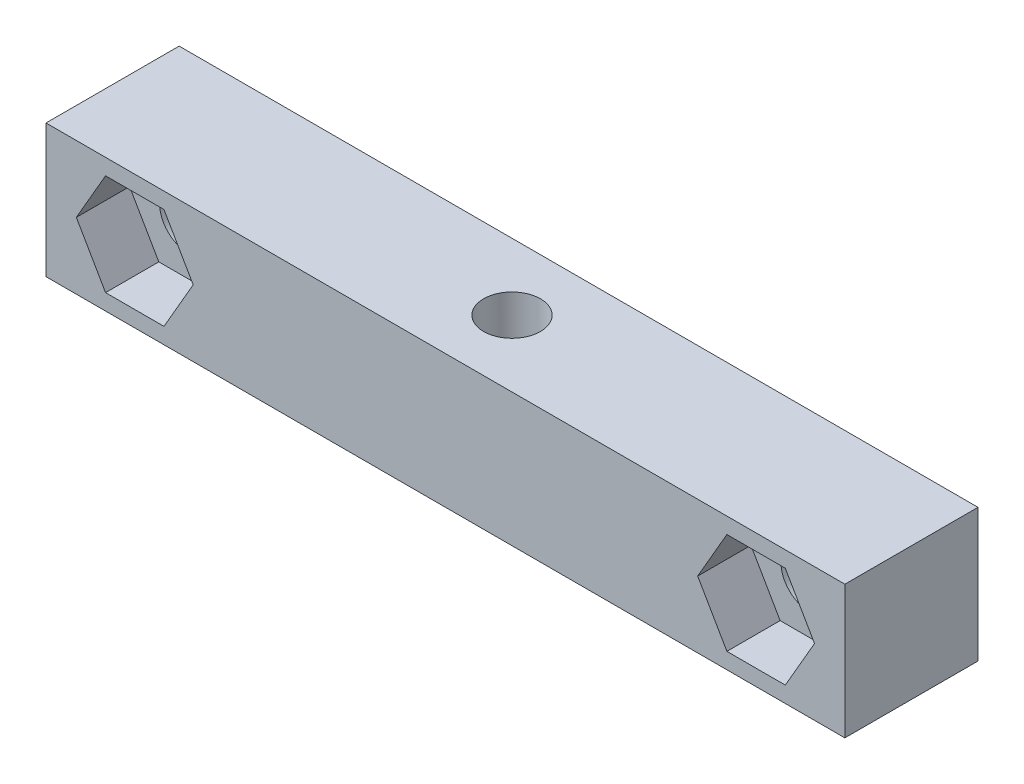
ISO-10303-21;
HEADER;
FILE_DESCRIPTION(('STEP AP214'),'2;1');
FILE_NAME('part.step','',(''),(''),'','','');
FILE_SCHEMA(('AUTOMOTIVE_DESIGN { 1 0 10303 214 1 1 1 1 }'));
ENDSEC;
DATA;
#1=APPLICATION_CONTEXT('core data for automotive mechanical design processes');
#2=APPLICATION_PROTOCOL_DEFINITION('international standard','automotive_design',2000,#1);
#3=PRODUCT_CONTEXT('',#1,'mechanical');
#4=PRODUCT('Part','Part','',(#3));
#5=PRODUCT_RELATED_PRODUCT_CATEGORY('part','',(#4));
#6=PRODUCT_DEFINITION_FORMATION('','',#4);
#7=PRODUCT_DEFINITION_CONTEXT('part definition',#1,'design');
#8=PRODUCT_DEFINITION('design','',#6,#7);
#9=PRODUCT_DEFINITION_SHAPE('','',#8);
#10=(LENGTH_UNIT() NAMED_UNIT(*) SI_UNIT(.MILLI.,.METRE.));
#11=(NAMED_UNIT(*) PLANE_ANGLE_UNIT() SI_UNIT($,.RADIAN.));
#12=(NAMED_UNIT(*) SI_UNIT($,.STERADIAN.) SOLID_ANGLE_UNIT());
#13=UNCERTAINTY_MEASURE_WITH_UNIT(LENGTH_MEASURE(1.E-05),#10,'distance_accuracy_value','');
#14=(GEOMETRIC_REPRESENTATION_CONTEXT(3) GLOBAL_UNCERTAINTY_ASSIGNED_CONTEXT((#13)) GLOBAL_UNIT_ASSIGNED_CONTEXT((#10,
#11,#12)) REPRESENTATION_CONTEXT('',''));
#15=CARTESIAN_POINT('',(0.,0.,0.));
#16=DIRECTION('',(0.,0.,1.));
#17=DIRECTION('',(1.,0.,0.));
#18=AXIS2_PLACEMENT_3D('',#15,#16,#17);
#19=CARTESIAN_POINT('',(17.5,0.,7.5));
#20=DIRECTION('',(0.,0.,-1.));
#21=DIRECTION('',(-1.,0.,0.));
#22=AXIS2_PLACEMENT_3D('',#19,#20,#21);
#23=CYLINDRICAL_SURFACE('',#22,1.6);
#24=CARTESIAN_POINT('',(17.5,0.,0.));
#25=DIRECTION('',(0.,0.,1.));
#26=DIRECTION('',(1.,0.,0.));
#27=AXIS2_PLACEMENT_3D('',#24,#25,#26);
#28=CIRCLE('',#27,1.6);
#29=CARTESIAN_POINT('',(19.1,0.,0.));
#30=VERTEX_POINT('',#29);
#31=EDGE_CURVE('E336',#30,#30,#28,.T.);
#32=ORIENTED_EDGE('',*,*,#31,.F.);
#33=EDGE_LOOP('',(#32));
#34=FACE_BOUND('',#33,.T.);
#35=CARTESIAN_POINT('',(17.5,0.,4.5));
#36=DIRECTION('',(0.,0.,1.));
#37=DIRECTION('',(1.,0.,0.));
#38=AXIS2_PLACEMENT_3D('',#35,#36,#37);
#39=CIRCLE('',#38,1.6);
#40=CARTESIAN_POINT('',(19.1,0.,4.5));
#41=VERTEX_POINT('',#40);
#42=EDGE_CURVE('E36',#41,#41,#39,.T.);
#43=ORIENTED_EDGE('',*,*,#42,.T.);
#44=EDGE_LOOP('',(#43));
#45=FACE_BOUND('',#44,.T.);
#46=ADVANCED_FACE('F32',(#34,#45),#23,.F.);
#47=CARTESIAN_POINT('',(-17.5,0.,7.5));
#48=DIRECTION('',(0.,0.,-1.));
#49=DIRECTION('',(-1.,0.,0.));
#50=AXIS2_PLACEMENT_3D('',#47,#48,#49);
#51=CYLINDRICAL_SURFACE('',#50,1.6);
#52=CARTESIAN_POINT('',(-17.5,0.,0.));
#53=DIRECTION('',(0.,0.,1.));
#54=DIRECTION('',(1.,0.,0.));
#55=AXIS2_PLACEMENT_3D('',#52,#53,#54);
#56=CIRCLE('',#55,1.6);
#57=CARTESIAN_POINT('',(-15.9,0.,0.));
#58=VERTEX_POINT('',#57);
#59=EDGE_CURVE('E339',#58,#58,#56,.T.);
#60=ORIENTED_EDGE('',*,*,#59,.F.);
#61=EDGE_LOOP('',(#60));
#62=FACE_BOUND('',#61,.T.);
#63=CARTESIAN_POINT('',(-17.5,0.,4.5));
#64=DIRECTION('',(0.,0.,1.));
#65=DIRECTION('',(1.,0.,0.));
#66=AXIS2_PLACEMENT_3D('',#63,#64,#65);
#67=CIRCLE('',#66,1.6);
#68=CARTESIAN_POINT('',(-15.9,0.,4.5));
#69=VERTEX_POINT('',#68);
#70=EDGE_CURVE('E274',#69,#69,#67,.T.);
#71=ORIENTED_EDGE('',*,*,#70,.T.);
#72=EDGE_LOOP('',(#71));
#73=FACE_BOUND('',#72,.T.);
#74=ADVANCED_FACE('F372',(#62,#73),#51,.F.);
#75=CARTESIAN_POINT('',(-1.1149224868951E-13,-3.75100000000001,3.75));
#76=DIRECTION('',(0.,1.,0.));
#77=DIRECTION('',(-1.,0.,0.));
#78=AXIS2_PLACEMENT_3D('',#75,#76,#77);
#79=CYLINDRICAL_SURFACE('',#78,1.6);
#80=CARTESIAN_POINT('',(-1.10552481521105E-13,3.74999999999999,3.75));
#81=DIRECTION('',(0.,1.,0.));
#82=DIRECTION('',(-1.,0.,0.));
#83=AXIS2_PLACEMENT_3D('',#80,#81,#82);
#84=CIRCLE('',#83,1.6);
#85=CARTESIAN_POINT('',(-1.60000000000011,3.74999999999999,3.75));
#86=VERTEX_POINT('',#85);
#87=EDGE_CURVE('E333',#86,#86,#84,.T.);
#88=ORIENTED_EDGE('',*,*,#87,.T.);
#89=EDGE_LOOP('',(#88));
#90=FACE_BOUND('',#89,.T.);
#91=CARTESIAN_POINT('',(-1.11116266650798E-13,-0.749999999999997,3.75));
#92=DIRECTION('',(0.,-1.,0.));
#93=DIRECTION('',(1.,0.,0.));
#94=AXIS2_PLACEMENT_3D('',#91,#92,#93);
#95=CIRCLE('',#94,1.6);
#96=CARTESIAN_POINT('',(1.59999999999989,-0.749999999999996,3.75));
#97=VERTEX_POINT('',#96);
#98=EDGE_CURVE('E322',#97,#97,#95,.F.);
#99=ORIENTED_EDGE('',*,*,#98,.F.);
#100=EDGE_LOOP('',(#99));
#101=FACE_BOUND('',#100,.T.);
#102=ADVANCED_FACE('F405',(#90,#101),#79,.F.);
#103=CARTESIAN_POINT('',(-22.5000000000001,3.74999999999999,7.5));
#104=DIRECTION('',(0.,0.,1.));
#105=DIRECTION('',(1.,0.,0.));
#106=AXIS2_PLACEMENT_3D('',#103,#104,#105);
#107=PLANE('',#106);
#108=DIRECTION('',(0.5,0.866025403784439,0.));
#109=VECTOR('',#108,1.);
#110=CARTESIAN_POINT('',(19.1454482671904,-2.85,7.5));
#111=LINE('',#110,#109);
#112=CARTESIAN_POINT('',(19.1454482671904,-2.85,7.5));
#113=VERTEX_POINT('',#112);
#114=CARTESIAN_POINT('',(20.7908965343809,0.,7.5));
#115=VERTEX_POINT('',#114);
#116=EDGE_CURVE('E49',#113,#115,#111,.T.);
#117=ORIENTED_EDGE('',*,*,#116,.F.);
#118=DIRECTION('',(1.,0.,0.));
#119=VECTOR('',#118,1.);
#120=CARTESIAN_POINT('',(15.8545517328096,-2.85,7.5));
#121=LINE('',#120,#119);
#122=CARTESIAN_POINT('',(15.8545517328096,-2.85,7.5));
#123=VERTEX_POINT('',#122);
#124=EDGE_CURVE('E204',#123,#113,#121,.T.);
#125=ORIENTED_EDGE('',*,*,#124,.F.);
#126=DIRECTION('',(0.5,-0.866025403784439,0.));
#127=VECTOR('',#126,1.);
#128=CARTESIAN_POINT('',(14.2091034656191,0.,7.5));
#129=LINE('',#128,#127);
#130=CARTESIAN_POINT('',(14.2091034656191,0.,7.5));
#131=VERTEX_POINT('',#130);
#132=EDGE_CURVE('E207',#131,#123,#129,.T.);
#133=ORIENTED_EDGE('',*,*,#132,.F.);
#134=DIRECTION('',(-0.5,-0.866025403784438,0.));
#135=VECTOR('',#134,1.);
#136=CARTESIAN_POINT('',(15.8545517328096,2.85,7.5));
#137=LINE('',#136,#135);
#138=CARTESIAN_POINT('',(15.8545517328096,2.85,7.5));
#139=VERTEX_POINT('',#138);
#140=EDGE_CURVE('E223',#139,#131,#137,.T.);
#141=ORIENTED_EDGE('',*,*,#140,.F.);
#142=DIRECTION('',(-1.,0.,0.));
#143=VECTOR('',#142,1.);
#144=CARTESIAN_POINT('',(19.1454482671904,2.85,7.5));
#145=LINE('',#144,#143);
#146=CARTESIAN_POINT('',(19.1454482671904,2.85,7.5));
#147=VERTEX_POINT('',#146);
#148=EDGE_CURVE('E220',#147,#139,#145,.T.);
#149=ORIENTED_EDGE('',*,*,#148,.F.);
#150=DIRECTION('',(-0.5,0.866025403784439,0.));
#151=VECTOR('',#150,1.);
#152=CARTESIAN_POINT('',(20.7908965343809,0.,7.5));
#153=LINE('',#152,#151);
#154=EDGE_CURVE('E218',#115,#147,#153,.T.);
#155=ORIENTED_EDGE('',*,*,#154,.F.);
#156=EDGE_LOOP('',(#117,#125,#133,#141,#149,#155));
#157=FACE_BOUND('',#156,.T.);
#158=DIRECTION('',(0.5,0.866025403784439,0.));
#159=VECTOR('',#158,1.);
#160=CARTESIAN_POINT('',(-15.8545517328096,-2.85,7.5));
#161=LINE('',#160,#159);
#162=CARTESIAN_POINT('',(-15.8545517328096,-2.85,7.5));
#163=VERTEX_POINT('',#162);
#164=CARTESIAN_POINT('',(-14.2091034656191,0.,7.5));
#165=VERTEX_POINT('',#164);
#166=EDGE_CURVE('E57',#163,#165,#161,.T.);
#167=ORIENTED_EDGE('',*,*,#166,.F.);
#168=DIRECTION('',(1.,0.,0.));
#169=VECTOR('',#168,1.);
#170=CARTESIAN_POINT('',(-19.1454482671904,-2.85,7.5));
#171=LINE('',#170,#169);
#172=CARTESIAN_POINT('',(-19.1454482671904,-2.85,7.5));
#173=VERTEX_POINT('',#172);
#174=EDGE_CURVE('E241',#173,#163,#171,.T.);
#175=ORIENTED_EDGE('',*,*,#174,.F.);
#176=DIRECTION('',(0.5,-0.866025403784439,0.));
#177=VECTOR('',#176,1.);
#178=CARTESIAN_POINT('',(-20.7908965343809,0.,7.5));
#179=LINE('',#178,#177);
#180=CARTESIAN_POINT('',(-20.7908965343809,0.,7.5));
#181=VERTEX_POINT('',#180);
#182=EDGE_CURVE('E267',#181,#173,#179,.T.);
#183=ORIENTED_EDGE('',*,*,#182,.F.);
#184=DIRECTION('',(-0.5,-0.866025403784439,0.));
#185=VECTOR('',#184,1.);
#186=CARTESIAN_POINT('',(-19.1454482671904,2.85000000000001,7.5));
#187=LINE('',#186,#185);
#188=CARTESIAN_POINT('',(-19.1454482671904,2.85000000000001,7.5));
#189=VERTEX_POINT('',#188);
#190=EDGE_CURVE('E264',#189,#181,#187,.T.);
#191=ORIENTED_EDGE('',*,*,#190,.F.);
#192=DIRECTION('',(-1.,0.,0.));
#193=VECTOR('',#192,1.);
#194=CARTESIAN_POINT('',(-15.8545517328096,2.85000000000001,7.5));
#195=LINE('',#194,#193);
#196=CARTESIAN_POINT('',(-15.8545517328096,2.85000000000001,7.5));
#197=VERTEX_POINT('',#196);
#198=EDGE_CURVE('E261',#197,#189,#195,.T.);
#199=ORIENTED_EDGE('',*,*,#198,.F.);
#200=DIRECTION('',(-0.5,0.866025403784439,0.));
#201=VECTOR('',#200,1.);
#202=CARTESIAN_POINT('',(-14.2091034656191,0.,7.5));
#203=LINE('',#202,#201);
#204=EDGE_CURVE('E258',#165,#197,#203,.T.);
#205=ORIENTED_EDGE('',*,*,#204,.F.);
#206=EDGE_LOOP('',(#167,#175,#183,#191,#199,#205));
#207=FACE_BOUND('',#206,.T.);
#208=DIRECTION('',(0.,-1.,0.));
#209=VECTOR('',#208,1.);
#210=CARTESIAN_POINT('',(-22.5000000000001,-3.75000000000001,7.5));
#211=LINE('',#210,#209);
#212=CARTESIAN_POINT('',(-22.5000000000001,3.74999999999999,7.5));
#213=VERTEX_POINT('',#212);
#214=CARTESIAN_POINT('',(-22.5000000000001,-3.75000000000001,7.5));
#215=VERTEX_POINT('',#214);
#216=EDGE_CURVE('E343',#213,#215,#211,.T.);
#217=ORIENTED_EDGE('',*,*,#216,.T.);
#218=DIRECTION('',(1.,0.,0.));
#219=VECTOR('',#218,1.);
#220=CARTESIAN_POINT('',(22.4999999999999,-3.74999999999998,7.5));
#221=LINE('',#220,#219);
#222=CARTESIAN_POINT('',(22.4999999999999,-3.74999999999998,7.5));
#223=VERTEX_POINT('',#222);
#224=EDGE_CURVE('E346',#215,#223,#221,.T.);
#225=ORIENTED_EDGE('',*,*,#224,.T.);
#226=DIRECTION('',(0.,1.,0.));
#227=VECTOR('',#226,1.);
#228=CARTESIAN_POINT('',(22.4999999999999,-3.74999999999998,7.5));
#229=LINE('',#228,#227);
#230=CARTESIAN_POINT('',(22.4999999999999,3.74999999999998,7.5));
#231=VERTEX_POINT('',#230);
#232=EDGE_CURVE('E349',#223,#231,#229,.T.);
#233=ORIENTED_EDGE('',*,*,#232,.T.);
#234=DIRECTION('',(-1.,0.,0.));
#235=VECTOR('',#234,1.);
#236=CARTESIAN_POINT('',(22.4999999999999,3.74999999999998,7.5));
#237=LINE('',#236,#235);
#238=EDGE_CURVE('E351',#231,#213,#237,.T.);
#239=ORIENTED_EDGE('',*,*,#238,.T.);
#240=EDGE_LOOP('',(#217,#225,#233,#239));
#241=FACE_BOUND('',#240,.T.);
#242=ADVANCED_FACE('F401',(#157,#207,#241),#107,.T.);
#243=CARTESIAN_POINT('',(-22.5000000000001,3.74999999999999,0.));
#244=DIRECTION('',(0.,0.,1.));
#245=DIRECTION('',(1.,0.,0.));
#246=AXIS2_PLACEMENT_3D('',#243,#244,#245);
#247=PLANE('',#246);
#248=ORIENTED_EDGE('',*,*,#59,.T.);
#249=EDGE_LOOP('',(#248));
#250=FACE_BOUND('',#249,.T.);
#251=DIRECTION('',(0.,-1.,0.));
#252=VECTOR('',#251,1.);
#253=CARTESIAN_POINT('',(-22.5000000000001,-3.75000000000001,0.));
#254=LINE('',#253,#252);
#255=CARTESIAN_POINT('',(-22.5000000000001,3.74999999999999,0.));
#256=VERTEX_POINT('',#255);
#257=CARTESIAN_POINT('',(-22.5000000000001,-3.75000000000001,0.));
#258=VERTEX_POINT('',#257);
#259=EDGE_CURVE('E342',#256,#258,#254,.T.);
#260=ORIENTED_EDGE('',*,*,#259,.F.);
#261=DIRECTION('',(-1.,0.,0.));
#262=VECTOR('',#261,1.);
#263=CARTESIAN_POINT('',(22.4999999999999,3.74999999999998,0.));
#264=LINE('',#263,#262);
#265=CARTESIAN_POINT('',(22.4999999999999,3.74999999999998,0.));
#266=VERTEX_POINT('',#265);
#267=EDGE_CURVE('E347',#266,#256,#264,.T.);
#268=ORIENTED_EDGE('',*,*,#267,.F.);
#269=DIRECTION('',(0.,1.,0.));
#270=VECTOR('',#269,1.);
#271=CARTESIAN_POINT('',(22.4999999999999,-3.74999999999998,0.));
#272=LINE('',#271,#270);
#273=CARTESIAN_POINT('',(22.4999999999999,-3.74999999999998,0.));
#274=VERTEX_POINT('',#273);
#275=EDGE_CURVE('E358',#274,#266,#272,.T.);
#276=ORIENTED_EDGE('',*,*,#275,.F.);
#277=DIRECTION('',(1.,0.,0.));
#278=VECTOR('',#277,1.);
#279=CARTESIAN_POINT('',(22.4999999999999,-3.74999999999998,0.));
#280=LINE('',#279,#278);
#281=EDGE_CURVE('E356',#258,#274,#280,.T.);
#282=ORIENTED_EDGE('',*,*,#281,.F.);
#283=EDGE_LOOP('',(#260,#268,#276,#282));
#284=FACE_BOUND('',#283,.T.);
#285=ORIENTED_EDGE('',*,*,#31,.T.);
#286=EDGE_LOOP('',(#285));
#287=FACE_BOUND('',#286,.T.);
#288=ADVANCED_FACE('F404',(#250,#284,#287),#247,.F.);
#289=CARTESIAN_POINT('',(-22.5000000000001,-3.75000000000001,7.5));
#290=DIRECTION('',(1.,0.,0.));
#291=DIRECTION('',(0.,0.,-1.));
#292=AXIS2_PLACEMENT_3D('',#289,#290,#291);
#293=PLANE('',#292);
#294=ORIENTED_EDGE('',*,*,#259,.T.);
#295=DIRECTION('',(0.,0.,-1.));
#296=VECTOR('',#295,1.);
#297=CARTESIAN_POINT('',(-22.5000000000001,-3.75000000000001,7.5));
#298=LINE('',#297,#296);
#299=EDGE_CURVE('E11',#215,#258,#298,.T.);
#300=ORIENTED_EDGE('',*,*,#299,.F.);
#301=ORIENTED_EDGE('',*,*,#216,.F.);
#302=DIRECTION('',(0.,0.,-1.));
#303=VECTOR('',#302,1.);
#304=CARTESIAN_POINT('',(-22.5000000000001,3.74999999999999,7.5));
#305=LINE('',#304,#303);
#306=EDGE_CURVE('E353',#213,#256,#305,.T.);
#307=ORIENTED_EDGE('',*,*,#306,.T.);
#308=EDGE_LOOP('',(#294,#300,#301,#307));
#309=FACE_BOUND('',#308,.T.);
#310=ADVANCED_FACE('F34',(#309),#293,.F.);
#311=CARTESIAN_POINT('',(22.4999999999999,-3.74999999999998,7.5));
#312=DIRECTION('',(0.,1.,0.));
#313=DIRECTION('',(-1.,0.,0.));
#314=AXIS2_PLACEMENT_3D('',#311,#312,#313);
#315=PLANE('',#314);
#316=DIRECTION('',(-0.5,0.,0.866025403784439));
#317=VECTOR('',#316,1.);
#318=CARTESIAN_POINT('',(3.29089653438076,-3.74999999999999,3.75));
#319=LINE('',#318,#317);
#320=CARTESIAN_POINT('',(3.29089653438075,-3.74999999999999,3.75));
#321=VERTEX_POINT('',#320);
#322=CARTESIAN_POINT('',(1.64544826719032,-3.75,6.6));
#323=VERTEX_POINT('',#322);
#324=EDGE_CURVE('E306',#321,#323,#319,.T.);
#325=ORIENTED_EDGE('',*,*,#324,.F.);
#326=DIRECTION('',(0.5,0.,0.866025403784439));
#327=VECTOR('',#326,1.);
#328=CARTESIAN_POINT('',(1.64544826719032,-3.75,0.899999999999998));
#329=LINE('',#328,#327);
#330=CARTESIAN_POINT('',(1.64544826719032,-3.75,0.899999999999998));
#331=VERTEX_POINT('',#330);
#332=EDGE_CURVE('E304',#331,#321,#329,.T.);
#333=ORIENTED_EDGE('',*,*,#332,.F.);
#334=DIRECTION('',(1.,0.,0.));
#335=VECTOR('',#334,1.);
#336=CARTESIAN_POINT('',(-1.64544826719055,-3.75,0.899999999999999));
#337=LINE('',#336,#335);
#338=CARTESIAN_POINT('',(-1.64544826719055,-3.75,0.899999999999999));
#339=VERTEX_POINT('',#338);
#340=EDGE_CURVE('E288',#339,#331,#337,.T.);
#341=ORIENTED_EDGE('',*,*,#340,.F.);
#342=DIRECTION('',(0.5,0.,-0.866025403784439));
#343=VECTOR('',#342,1.);
#344=CARTESIAN_POINT('',(-3.29089653438098,-3.75,3.75));
#345=LINE('',#344,#343);
#346=CARTESIAN_POINT('',(-3.29089653438098,-3.75,3.75));
#347=VERTEX_POINT('',#346);
#348=EDGE_CURVE('E315',#347,#339,#345,.T.);
#349=ORIENTED_EDGE('',*,*,#348,.F.);
#350=DIRECTION('',(-0.5,0.,-0.866025403784439));
#351=VECTOR('',#350,1.);
#352=CARTESIAN_POINT('',(-1.64544826719055,-3.75,6.6));
#353=LINE('',#352,#351);
#354=CARTESIAN_POINT('',(-1.64544826719055,-3.75,6.6));
#355=VERTEX_POINT('',#354);
#356=EDGE_CURVE('E312',#355,#347,#353,.T.);
#357=ORIENTED_EDGE('',*,*,#356,.F.);
#358=DIRECTION('',(-1.,0.,0.));
#359=VECTOR('',#358,1.);
#360=CARTESIAN_POINT('',(1.64544826719032,-3.75,6.6));
#361=LINE('',#360,#359);
#362=EDGE_CURVE('E309',#323,#355,#361,.T.);
#363=ORIENTED_EDGE('',*,*,#362,.F.);
#364=EDGE_LOOP('',(#325,#333,#341,#349,#357,#363));
#365=FACE_BOUND('',#364,.T.);
#366=ORIENTED_EDGE('',*,*,#281,.T.);
#367=DIRECTION('',(0.,0.,-1.));
#368=VECTOR('',#367,1.);
#369=CARTESIAN_POINT('',(22.4999999999999,-3.74999999999998,7.5));
#370=LINE('',#369,#368);
#371=EDGE_CURVE('E41',#223,#274,#370,.T.);
#372=ORIENTED_EDGE('',*,*,#371,.F.);
#373=ORIENTED_EDGE('',*,*,#224,.F.);
#374=ORIENTED_EDGE('',*,*,#299,.T.);
#375=EDGE_LOOP('',(#366,#372,#373,#374));
#376=FACE_BOUND('',#375,.T.);
#377=ADVANCED_FACE('F416',(#365,#376),#315,.F.);
#378=CARTESIAN_POINT('',(22.4999999999999,-3.74999999999998,7.5));
#379=DIRECTION('',(-1.,0.,0.));
#380=DIRECTION('',(0.,0.,1.));
#381=AXIS2_PLACEMENT_3D('',#378,#379,#380);
#382=PLANE('',#381);
#383=ORIENTED_EDGE('',*,*,#275,.T.);
#384=DIRECTION('',(0.,0.,-1.));
#385=VECTOR('',#384,1.);
#386=CARTESIAN_POINT('',(22.4999999999999,3.74999999999998,7.5));
#387=LINE('',#386,#385);
#388=EDGE_CURVE('E363',#231,#266,#387,.T.);
#389=ORIENTED_EDGE('',*,*,#388,.F.);
#390=ORIENTED_EDGE('',*,*,#232,.F.);
#391=ORIENTED_EDGE('',*,*,#371,.T.);
#392=EDGE_LOOP('',(#383,#389,#390,#391));
#393=FACE_BOUND('',#392,.T.);
#394=ADVANCED_FACE('F421',(#393),#382,.F.);
#395=CARTESIAN_POINT('',(22.4999999999999,3.74999999999998,7.5));
#396=DIRECTION('',(0.,-1.,0.));
#397=DIRECTION('',(1.,0.,0.));
#398=AXIS2_PLACEMENT_3D('',#395,#396,#397);
#399=PLANE('',#398);
#400=ORIENTED_EDGE('',*,*,#87,.F.);
#401=EDGE_LOOP('',(#400));
#402=FACE_BOUND('',#401,.T.);
#403=ORIENTED_EDGE('',*,*,#267,.T.);
#404=ORIENTED_EDGE('',*,*,#306,.F.);
#405=ORIENTED_EDGE('',*,*,#238,.F.);
#406=ORIENTED_EDGE('',*,*,#388,.T.);
#407=EDGE_LOOP('',(#403,#404,#405,#406));
#408=FACE_BOUND('',#407,.T.);
#409=ADVANCED_FACE('F424',(#402,#408),#399,.F.);
#410=CARTESIAN_POINT('',(3.29089653438075,-0.749999999999995,3.75));
#411=DIRECTION('',(0.,-1.,0.));
#412=DIRECTION('',(1.,0.,0.));
#413=AXIS2_PLACEMENT_3D('',#410,#411,#412);
#414=PLANE('',#413);
#415=DIRECTION('',(0.5,0.,0.866025403784439));
#416=VECTOR('',#415,1.);
#417=CARTESIAN_POINT('',(1.64544826719032,-0.749999999999996,0.899999999999998));
#418=LINE('',#417,#416);
#419=CARTESIAN_POINT('',(1.64544826719032,-0.749999999999996,0.899999999999998));
#420=VERTEX_POINT('',#419);
#421=CARTESIAN_POINT('',(3.29089653438075,-0.749999999999995,3.75));
#422=VERTEX_POINT('',#421);
#423=EDGE_CURVE('E284',#420,#422,#418,.T.);
#424=ORIENTED_EDGE('',*,*,#423,.T.);
#425=DIRECTION('',(-0.5,0.,0.866025403784439));
#426=VECTOR('',#425,1.);
#427=CARTESIAN_POINT('',(3.29089653438075,-0.749999999999995,3.75));
#428=LINE('',#427,#426);
#429=CARTESIAN_POINT('',(1.64544826719032,-0.749999999999996,6.6));
#430=VERTEX_POINT('',#429);
#431=EDGE_CURVE('E287',#422,#430,#428,.T.);
#432=ORIENTED_EDGE('',*,*,#431,.T.);
#433=DIRECTION('',(-1.,0.,0.));
#434=VECTOR('',#433,1.);
#435=CARTESIAN_POINT('',(1.64544826719032,-0.749999999999996,6.6));
#436=LINE('',#435,#434);
#437=CARTESIAN_POINT('',(-1.64544826719055,-0.749999999999998,6.6));
#438=VERTEX_POINT('',#437);
#439=EDGE_CURVE('E291',#430,#438,#436,.T.);
#440=ORIENTED_EDGE('',*,*,#439,.T.);
#441=DIRECTION('',(-0.5,0.,-0.866025403784439));
#442=VECTOR('',#441,1.);
#443=CARTESIAN_POINT('',(-1.64544826719055,-0.749999999999998,6.6));
#444=LINE('',#443,#442);
#445=CARTESIAN_POINT('',(-3.29089653438098,-0.749999999999999,3.75));
#446=VERTEX_POINT('',#445);
#447=EDGE_CURVE('E294',#438,#446,#444,.T.);
#448=ORIENTED_EDGE('',*,*,#447,.T.);
#449=DIRECTION('',(0.5,0.,-0.866025403784439));
#450=VECTOR('',#449,1.);
#451=CARTESIAN_POINT('',(-3.29089653438098,-0.749999999999999,3.75));
#452=LINE('',#451,#450);
#453=CARTESIAN_POINT('',(-1.64544826719055,-0.749999999999998,0.899999999999999));
#454=VERTEX_POINT('',#453);
#455=EDGE_CURVE('E297',#446,#454,#452,.T.);
#456=ORIENTED_EDGE('',*,*,#455,.T.);
#457=DIRECTION('',(1.,0.,0.));
#458=VECTOR('',#457,1.);
#459=CARTESIAN_POINT('',(-1.64544826719055,-0.749999999999998,0.899999999999999));
#460=LINE('',#459,#458);
#461=EDGE_CURVE('E300',#454,#420,#460,.T.);
#462=ORIENTED_EDGE('',*,*,#461,.T.);
#463=EDGE_LOOP('',(#424,#432,#440,#448,#456,#462));
#464=FACE_BOUND('',#463,.T.);
#465=ORIENTED_EDGE('',*,*,#98,.T.);
#466=EDGE_LOOP('',(#465));
#467=FACE_BOUND('',#466,.T.);
#468=ADVANCED_FACE('F476',(#464,#467),#414,.T.);
#469=CARTESIAN_POINT('',(1.64544826719032,-0.749999999999996,0.899999999999998));
#470=DIRECTION('',(0.866025403784439,0.,-0.5));
#471=DIRECTION('',(-0.5,0.,-0.866025403784439));
#472=AXIS2_PLACEMENT_3D('',#469,#470,#471);
#473=PLANE('',#472);
#474=ORIENTED_EDGE('',*,*,#332,.T.);
#475=DIRECTION('',(0.,-1.,0.));
#476=VECTOR('',#475,1.);
#477=CARTESIAN_POINT('',(3.29089653438075,-0.749999999999995,3.75));
#478=LINE('',#477,#476);
#479=EDGE_CURVE('E303',#422,#321,#478,.T.);
#480=ORIENTED_EDGE('',*,*,#479,.F.);
#481=ORIENTED_EDGE('',*,*,#423,.F.);
#482=DIRECTION('',(0.,-1.,0.));
#483=VECTOR('',#482,1.);
#484=CARTESIAN_POINT('',(1.64544826719032,-0.749999999999996,0.899999999999998));
#485=LINE('',#484,#483);
#486=EDGE_CURVE('E320',#420,#331,#485,.T.);
#487=ORIENTED_EDGE('',*,*,#486,.T.);
#488=EDGE_LOOP('',(#474,#480,#481,#487));
#489=FACE_BOUND('',#488,.T.);
#490=ADVANCED_FACE('F479',(#489),#473,.F.);
#491=CARTESIAN_POINT('',(-1.64544826719055,-0.749999999999998,0.899999999999999));
#492=DIRECTION('',(0.,0.,-1.));
#493=DIRECTION('',(-1.,0.,0.));
#494=AXIS2_PLACEMENT_3D('',#491,#492,#493);
#495=PLANE('',#494);
#496=ORIENTED_EDGE('',*,*,#340,.T.);
#497=ORIENTED_EDGE('',*,*,#486,.F.);
#498=ORIENTED_EDGE('',*,*,#461,.F.);
#499=DIRECTION('',(0.,-1.,0.));
#500=VECTOR('',#499,1.);
#501=CARTESIAN_POINT('',(-1.64544826719055,-0.749999999999998,0.899999999999999));
#502=LINE('',#501,#500);
#503=EDGE_CURVE('E323',#454,#339,#502,.T.);
#504=ORIENTED_EDGE('',*,*,#503,.T.);
#505=EDGE_LOOP('',(#496,#497,#498,#504));
#506=FACE_BOUND('',#505,.T.);
#507=ADVANCED_FACE('F481',(#506),#495,.F.);
#508=CARTESIAN_POINT('',(-3.29089653438098,-0.749999999999999,3.75));
#509=DIRECTION('',(-0.866025403784439,0.,-0.5));
#510=DIRECTION('',(-0.5,0.,0.866025403784439));
#511=AXIS2_PLACEMENT_3D('',#508,#509,#510);
#512=PLANE('',#511);
#513=ORIENTED_EDGE('',*,*,#348,.T.);
#514=ORIENTED_EDGE('',*,*,#503,.F.);
#515=ORIENTED_EDGE('',*,*,#455,.F.);
#516=DIRECTION('',(0.,-1.,0.));
#517=VECTOR('',#516,1.);
#518=CARTESIAN_POINT('',(-3.29089653438098,-0.749999999999999,3.75));
#519=LINE('',#518,#517);
#520=EDGE_CURVE('E325',#446,#347,#519,.T.);
#521=ORIENTED_EDGE('',*,*,#520,.T.);
#522=EDGE_LOOP('',(#513,#514,#515,#521));
#523=FACE_BOUND('',#522,.T.);
#524=ADVANCED_FACE('F484',(#523),#512,.F.);
#525=CARTESIAN_POINT('',(-1.64544826719055,-0.749999999999998,6.6));
#526=DIRECTION('',(-0.866025403784439,0.,0.5));
#527=DIRECTION('',(0.5,0.,0.866025403784439));
#528=AXIS2_PLACEMENT_3D('',#525,#526,#527);
#529=PLANE('',#528);
#530=ORIENTED_EDGE('',*,*,#356,.T.);
#531=ORIENTED_EDGE('',*,*,#520,.F.);
#532=ORIENTED_EDGE('',*,*,#447,.F.);
#533=DIRECTION('',(0.,-1.,0.));
#534=VECTOR('',#533,1.);
#535=CARTESIAN_POINT('',(-1.64544826719055,-0.749999999999998,6.6));
#536=LINE('',#535,#534);
#537=EDGE_CURVE('E327',#438,#355,#536,.T.);
#538=ORIENTED_EDGE('',*,*,#537,.T.);
#539=EDGE_LOOP('',(#530,#531,#532,#538));
#540=FACE_BOUND('',#539,.T.);
#541=ADVANCED_FACE('F488',(#540),#529,.F.);
#542=CARTESIAN_POINT('',(1.64544826719032,-0.749999999999996,6.6));
#543=DIRECTION('',(0.,0.,1.));
#544=DIRECTION('',(1.,0.,0.));
#545=AXIS2_PLACEMENT_3D('',#542,#543,#544);
#546=PLANE('',#545);
#547=ORIENTED_EDGE('',*,*,#362,.T.);
#548=ORIENTED_EDGE('',*,*,#537,.F.);
#549=ORIENTED_EDGE('',*,*,#439,.F.);
#550=DIRECTION('',(0.,-1.,0.));
#551=VECTOR('',#550,1.);
#552=CARTESIAN_POINT('',(1.64544826719032,-0.749999999999996,6.6));
#553=LINE('',#552,#551);
#554=EDGE_CURVE('E329',#430,#323,#553,.T.);
#555=ORIENTED_EDGE('',*,*,#554,.T.);
#556=EDGE_LOOP('',(#547,#548,#549,#555));
#557=FACE_BOUND('',#556,.T.);
#558=ADVANCED_FACE('F492',(#557),#546,.F.);
#559=CARTESIAN_POINT('',(3.29089653438075,-0.749999999999995,3.75));
#560=DIRECTION('',(0.866025403784439,0.,0.5));
#561=DIRECTION('',(0.5,0.,-0.866025403784439));
#562=AXIS2_PLACEMENT_3D('',#559,#560,#561);
#563=PLANE('',#562);
#564=ORIENTED_EDGE('',*,*,#324,.T.);
#565=ORIENTED_EDGE('',*,*,#554,.F.);
#566=ORIENTED_EDGE('',*,*,#431,.F.);
#567=ORIENTED_EDGE('',*,*,#479,.T.);
#568=EDGE_LOOP('',(#564,#565,#566,#567));
#569=FACE_BOUND('',#568,.T.);
#570=ADVANCED_FACE('F475',(#569),#563,.F.);
#571=CARTESIAN_POINT('',(-15.8545517328096,-2.85,4.5));
#572=DIRECTION('',(0.866025403784439,-0.5,0.));
#573=DIRECTION('',(0.5,0.866025403784439,0.));
#574=AXIS2_PLACEMENT_3D('',#571,#572,#573);
#575=PLANE('',#574);
#576=ORIENTED_EDGE('',*,*,#166,.T.);
#577=DIRECTION('',(0.,0.,1.));
#578=VECTOR('',#577,1.);
#579=CARTESIAN_POINT('',(-14.2091034656191,0.,4.5));
#580=LINE('',#579,#578);
#581=CARTESIAN_POINT('',(-14.2091034656191,0.,4.5));
#582=VERTEX_POINT('',#581);
#583=EDGE_CURVE('E256',#582,#165,#580,.T.);
#584=ORIENTED_EDGE('',*,*,#583,.F.);
#585=DIRECTION('',(0.5,0.866025403784439,0.));
#586=VECTOR('',#585,1.);
#587=CARTESIAN_POINT('',(-15.8545517328096,-2.85,4.5));
#588=LINE('',#587,#586);
#589=CARTESIAN_POINT('',(-15.8545517328096,-2.85,4.5));
#590=VERTEX_POINT('',#589);
#591=EDGE_CURVE('E237',#590,#582,#588,.T.);
#592=ORIENTED_EDGE('',*,*,#591,.F.);
#593=DIRECTION('',(0.,0.,1.));
#594=VECTOR('',#593,1.);
#595=CARTESIAN_POINT('',(-15.8545517328096,-2.85,4.5));
#596=LINE('',#595,#594);
#597=EDGE_CURVE('E272',#590,#163,#596,.T.);
#598=ORIENTED_EDGE('',*,*,#597,.T.);
#599=EDGE_LOOP('',(#576,#584,#592,#598));
#600=FACE_BOUND('',#599,.T.);
#601=ADVANCED_FACE('F382',(#600),#575,.F.);
#602=CARTESIAN_POINT('',(-19.1454482671904,-2.85,4.5));
#603=DIRECTION('',(0.,-1.,0.));
#604=DIRECTION('',(0.,0.,-1.));
#605=AXIS2_PLACEMENT_3D('',#602,#603,#604);
#606=PLANE('',#605);
#607=ORIENTED_EDGE('',*,*,#174,.T.);
#608=ORIENTED_EDGE('',*,*,#597,.F.);
#609=DIRECTION('',(1.,0.,0.));
#610=VECTOR('',#609,1.);
#611=CARTESIAN_POINT('',(-19.1454482671904,-2.85,4.5));
#612=LINE('',#611,#610);
#613=CARTESIAN_POINT('',(-19.1454482671904,-2.85,4.5));
#614=VERTEX_POINT('',#613);
#615=EDGE_CURVE('E253',#614,#590,#612,.T.);
#616=ORIENTED_EDGE('',*,*,#615,.F.);
#617=DIRECTION('',(0.,0.,1.));
#618=VECTOR('',#617,1.);
#619=CARTESIAN_POINT('',(-19.1454482671904,-2.85,4.5));
#620=LINE('',#619,#618);
#621=EDGE_CURVE('E275',#614,#173,#620,.T.);
#622=ORIENTED_EDGE('',*,*,#621,.T.);
#623=EDGE_LOOP('',(#607,#608,#616,#622));
#624=FACE_BOUND('',#623,.T.);
#625=ADVANCED_FACE('F399',(#624),#606,.F.);
#626=CARTESIAN_POINT('',(-20.7908965343809,0.,4.5));
#627=DIRECTION('',(-0.866025403784439,-0.5,0.));
#628=DIRECTION('',(0.5,-0.866025403784439,0.));
#629=AXIS2_PLACEMENT_3D('',#626,#627,#628);
#630=PLANE('',#629);
#631=ORIENTED_EDGE('',*,*,#182,.T.);
#632=ORIENTED_EDGE('',*,*,#621,.F.);
#633=DIRECTION('',(0.5,-0.866025403784439,0.));
#634=VECTOR('',#633,1.);
#635=CARTESIAN_POINT('',(-20.7908965343809,0.,4.5));
#636=LINE('',#635,#634);
#637=CARTESIAN_POINT('',(-20.7908965343809,0.,4.5));
#638=VERTEX_POINT('',#637);
#639=EDGE_CURVE('E250',#638,#614,#636,.T.);
#640=ORIENTED_EDGE('',*,*,#639,.F.);
#641=DIRECTION('',(0.,0.,1.));
#642=VECTOR('',#641,1.);
#643=CARTESIAN_POINT('',(-20.7908965343809,0.,4.5));
#644=LINE('',#643,#642);
#645=EDGE_CURVE('E277',#638,#181,#644,.T.);
#646=ORIENTED_EDGE('',*,*,#645,.T.);
#647=EDGE_LOOP('',(#631,#632,#640,#646));
#648=FACE_BOUND('',#647,.T.);
#649=ADVANCED_FACE('F396',(#648),#630,.F.);
#650=CARTESIAN_POINT('',(-19.1454482671904,2.85000000000001,4.5));
#651=DIRECTION('',(-0.866025403784439,0.5,0.));
#652=DIRECTION('',(-0.5,-0.866025403784439,0.));
#653=AXIS2_PLACEMENT_3D('',#650,#651,#652);
#654=PLANE('',#653);
#655=ORIENTED_EDGE('',*,*,#190,.T.);
#656=ORIENTED_EDGE('',*,*,#645,.F.);
#657=DIRECTION('',(-0.5,-0.866025403784439,0.));
#658=VECTOR('',#657,1.);
#659=CARTESIAN_POINT('',(-19.1454482671904,2.85000000000001,4.5));
#660=LINE('',#659,#658);
#661=CARTESIAN_POINT('',(-19.1454482671904,2.85000000000001,4.5));
#662=VERTEX_POINT('',#661);
#663=EDGE_CURVE('E247',#662,#638,#660,.T.);
#664=ORIENTED_EDGE('',*,*,#663,.F.);
#665=DIRECTION('',(0.,0.,1.));
#666=VECTOR('',#665,1.);
#667=CARTESIAN_POINT('',(-19.1454482671904,2.85000000000001,4.5));
#668=LINE('',#667,#666);
#669=EDGE_CURVE('E279',#662,#189,#668,.T.);
#670=ORIENTED_EDGE('',*,*,#669,.T.);
#671=EDGE_LOOP('',(#655,#656,#664,#670));
#672=FACE_BOUND('',#671,.T.);
#673=ADVANCED_FACE('F392',(#672),#654,.F.);
#674=CARTESIAN_POINT('',(-15.8545517328096,2.85000000000001,4.5));
#675=DIRECTION('',(0.,1.,0.));
#676=DIRECTION('',(-1.,0.,0.));
#677=AXIS2_PLACEMENT_3D('',#674,#675,#676);
#678=PLANE('',#677);
#679=ORIENTED_EDGE('',*,*,#198,.T.);
#680=ORIENTED_EDGE('',*,*,#669,.F.);
#681=DIRECTION('',(-1.,0.,0.));
#682=VECTOR('',#681,1.);
#683=CARTESIAN_POINT('',(-15.8545517328096,2.85000000000001,4.5));
#684=LINE('',#683,#682);
#685=CARTESIAN_POINT('',(-15.8545517328096,2.85000000000001,4.5));
#686=VERTEX_POINT('',#685);
#687=EDGE_CURVE('E244',#686,#662,#684,.T.);
#688=ORIENTED_EDGE('',*,*,#687,.F.);
#689=DIRECTION('',(0.,0.,1.));
#690=VECTOR('',#689,1.);
#691=CARTESIAN_POINT('',(-15.8545517328096,2.85000000000001,4.5));
#692=LINE('',#691,#690);
#693=EDGE_CURVE('E281',#686,#197,#692,.T.);
#694=ORIENTED_EDGE('',*,*,#693,.T.);
#695=EDGE_LOOP('',(#679,#680,#688,#694));
#696=FACE_BOUND('',#695,.T.);
#697=ADVANCED_FACE('F388',(#696),#678,.F.);
#698=CARTESIAN_POINT('',(-14.2091034656191,0.,4.5));
#699=DIRECTION('',(0.866025403784439,0.5,0.));
#700=DIRECTION('',(-0.5,0.866025403784439,0.));
#701=AXIS2_PLACEMENT_3D('',#698,#699,#700);
#702=PLANE('',#701);
#703=ORIENTED_EDGE('',*,*,#204,.T.);
#704=ORIENTED_EDGE('',*,*,#693,.F.);
#705=DIRECTION('',(-0.5,0.866025403784439,0.));
#706=VECTOR('',#705,1.);
#707=CARTESIAN_POINT('',(-14.2091034656191,0.,4.5));
#708=LINE('',#707,#706);
#709=EDGE_CURVE('E240',#582,#686,#708,.T.);
#710=ORIENTED_EDGE('',*,*,#709,.F.);
#711=ORIENTED_EDGE('',*,*,#583,.T.);
#712=EDGE_LOOP('',(#703,#704,#710,#711));
#713=FACE_BOUND('',#712,.T.);
#714=ADVANCED_FACE('F377',(#713),#702,.F.);
#715=CARTESIAN_POINT('',(-14.2091034656191,0.,4.5));
#716=DIRECTION('',(0.,0.,1.));
#717=DIRECTION('',(1.,0.,0.));
#718=AXIS2_PLACEMENT_3D('',#715,#716,#717);
#719=PLANE('',#718);
#720=ORIENTED_EDGE('',*,*,#70,.F.);
#721=EDGE_LOOP('',(#720));
#722=FACE_BOUND('',#721,.T.);
#723=ORIENTED_EDGE('',*,*,#591,.T.);
#724=ORIENTED_EDGE('',*,*,#709,.T.);
#725=ORIENTED_EDGE('',*,*,#687,.T.);
#726=ORIENTED_EDGE('',*,*,#663,.T.);
#727=ORIENTED_EDGE('',*,*,#639,.T.);
#728=ORIENTED_EDGE('',*,*,#615,.T.);
#729=EDGE_LOOP('',(#723,#724,#725,#726,#727,#728));
#730=FACE_BOUND('',#729,.T.);
#731=ADVANCED_FACE('F374',(#722,#730),#719,.T.);
#732=CARTESIAN_POINT('',(19.1454482671904,-2.85,4.5));
#733=DIRECTION('',(0.866025403784439,-0.5,0.));
#734=DIRECTION('',(0.5,0.866025403784439,0.));
#735=AXIS2_PLACEMENT_3D('',#732,#733,#734);
#736=PLANE('',#735);
#737=ORIENTED_EDGE('',*,*,#116,.T.);
#738=DIRECTION('',(0.,0.,1.));
#739=VECTOR('',#738,1.);
#740=CARTESIAN_POINT('',(20.7908965343809,0.,4.5));
#741=LINE('',#740,#739);
#742=CARTESIAN_POINT('',(20.7908965343809,0.,4.5));
#743=VERTEX_POINT('',#742);
#744=EDGE_CURVE('E181',#743,#115,#741,.T.);
#745=ORIENTED_EDGE('',*,*,#744,.F.);
#746=DIRECTION('',(0.5,0.866025403784439,0.));
#747=VECTOR('',#746,1.);
#748=CARTESIAN_POINT('',(19.1454482671904,-2.85,4.5));
#749=LINE('',#748,#747);
#750=CARTESIAN_POINT('',(19.1454482671904,-2.85,4.5));
#751=VERTEX_POINT('',#750);
#752=EDGE_CURVE('E185',#751,#743,#749,.T.);
#753=ORIENTED_EDGE('',*,*,#752,.F.);
#754=DIRECTION('',(0.,0.,1.));
#755=VECTOR('',#754,1.);
#756=CARTESIAN_POINT('',(19.1454482671904,-2.85,4.5));
#757=LINE('',#756,#755);
#758=EDGE_CURVE('E228',#751,#113,#757,.T.);
#759=ORIENTED_EDGE('',*,*,#758,.T.);
#760=EDGE_LOOP('',(#737,#745,#753,#759));
#761=FACE_BOUND('',#760,.T.);
#762=ADVANCED_FACE('F183',(#761),#736,.F.);
#763=CARTESIAN_POINT('',(15.8545517328096,-2.85,4.5));
#764=DIRECTION('',(0.,-1.,0.));
#765=DIRECTION('',(0.,0.,-1.));
#766=AXIS2_PLACEMENT_3D('',#763,#764,#765);
#767=PLANE('',#766);
#768=ORIENTED_EDGE('',*,*,#124,.T.);
#769=ORIENTED_EDGE('',*,*,#758,.F.);
#770=DIRECTION('',(1.,0.,0.));
#771=VECTOR('',#770,1.);
#772=CARTESIAN_POINT('',(15.8545517328096,-2.85,4.5));
#773=LINE('',#772,#771);
#774=CARTESIAN_POINT('',(15.8545517328096,-2.85,4.5));
#775=VERTEX_POINT('',#774);
#776=EDGE_CURVE('E191',#775,#751,#773,.T.);
#777=ORIENTED_EDGE('',*,*,#776,.F.);
#778=DIRECTION('',(0.,0.,1.));
#779=VECTOR('',#778,1.);
#780=CARTESIAN_POINT('',(15.8545517328096,-2.85,4.5));
#781=LINE('',#780,#779);
#782=EDGE_CURVE('E230',#775,#123,#781,.T.);
#783=ORIENTED_EDGE('',*,*,#782,.T.);
#784=EDGE_LOOP('',(#768,#769,#777,#783));
#785=FACE_BOUND('',#784,.T.);
#786=ADVANCED_FACE('F446',(#785),#767,.F.);
#787=CARTESIAN_POINT('',(14.2091034656191,0.,4.5));
#788=DIRECTION('',(-0.866025403784439,-0.5,0.));
#789=DIRECTION('',(0.5,-0.866025403784439,0.));
#790=AXIS2_PLACEMENT_3D('',#787,#788,#789);
#791=PLANE('',#790);
#792=ORIENTED_EDGE('',*,*,#132,.T.);
#793=ORIENTED_EDGE('',*,*,#782,.F.);
#794=DIRECTION('',(0.5,-0.866025403784439,0.));
#795=VECTOR('',#794,1.);
#796=CARTESIAN_POINT('',(14.2091034656191,0.,4.5));
#797=LINE('',#796,#795);
#798=CARTESIAN_POINT('',(14.2091034656191,0.,4.5));
#799=VERTEX_POINT('',#798);
#800=EDGE_CURVE('E214',#799,#775,#797,.T.);
#801=ORIENTED_EDGE('',*,*,#800,.F.);
#802=DIRECTION('',(0.,0.,1.));
#803=VECTOR('',#802,1.);
#804=CARTESIAN_POINT('',(14.2091034656191,0.,4.5));
#805=LINE('',#804,#803);
#806=EDGE_CURVE('E232',#799,#131,#805,.T.);
#807=ORIENTED_EDGE('',*,*,#806,.T.);
#808=EDGE_LOOP('',(#792,#793,#801,#807));
#809=FACE_BOUND('',#808,.T.);
#810=ADVANCED_FACE('F449',(#809),#791,.F.);
#811=CARTESIAN_POINT('',(15.8545517328096,2.85,4.5));
#812=DIRECTION('',(-0.866025403784438,0.5,0.));
#813=DIRECTION('',(-0.5,-0.866025403784439,0.));
#814=AXIS2_PLACEMENT_3D('',#811,#812,#813);
#815=PLANE('',#814);
#816=ORIENTED_EDGE('',*,*,#140,.T.);
#817=ORIENTED_EDGE('',*,*,#806,.F.);
#818=DIRECTION('',(-0.5,-0.866025403784438,0.));
#819=VECTOR('',#818,1.);
#820=CARTESIAN_POINT('',(15.8545517328096,2.85,4.5));
#821=LINE('',#820,#819);
#822=CARTESIAN_POINT('',(15.8545517328096,2.85,4.5));
#823=VERTEX_POINT('',#822);
#824=EDGE_CURVE('E211',#823,#799,#821,.T.);
#825=ORIENTED_EDGE('',*,*,#824,.F.);
#826=DIRECTION('',(0.,0.,1.));
#827=VECTOR('',#826,1.);
#828=CARTESIAN_POINT('',(15.8545517328096,2.85,4.5));
#829=LINE('',#828,#827);
#830=EDGE_CURVE('E234',#823,#139,#829,.T.);
#831=ORIENTED_EDGE('',*,*,#830,.T.);
#832=EDGE_LOOP('',(#816,#817,#825,#831));
#833=FACE_BOUND('',#832,.T.);
#834=ADVANCED_FACE('F453',(#833),#815,.F.);
#835=CARTESIAN_POINT('',(19.1454482671904,2.85,4.5));
#836=DIRECTION('',(0.,1.,0.));
#837=DIRECTION('',(-1.,0.,0.));
#838=AXIS2_PLACEMENT_3D('',#835,#836,#837);
#839=PLANE('',#838);
#840=ORIENTED_EDGE('',*,*,#148,.T.);
#841=ORIENTED_EDGE('',*,*,#830,.F.);
#842=DIRECTION('',(-1.,0.,0.));
#843=VECTOR('',#842,1.);
#844=CARTESIAN_POINT('',(19.1454482671904,2.85,4.5));
#845=LINE('',#844,#843);
#846=CARTESIAN_POINT('',(19.1454482671904,2.85,4.5));
#847=VERTEX_POINT('',#846);
#848=EDGE_CURVE('E199',#847,#823,#845,.T.);
#849=ORIENTED_EDGE('',*,*,#848,.F.);
#850=DIRECTION('',(0.,0.,1.));
#851=VECTOR('',#850,1.);
#852=CARTESIAN_POINT('',(19.1454482671904,2.85,4.5));
#853=LINE('',#852,#851);
#854=EDGE_CURVE('E190',#847,#147,#853,.T.);
#855=ORIENTED_EDGE('',*,*,#854,.T.);
#856=EDGE_LOOP('',(#840,#841,#849,#855));
#857=FACE_BOUND('',#856,.T.);
#858=ADVANCED_FACE('F443',(#857),#839,.F.);
#859=CARTESIAN_POINT('',(20.7908965343809,0.,4.5));
#860=DIRECTION('',(0.866025403784439,0.5,0.));
#861=DIRECTION('',(-0.5,0.866025403784439,0.));
#862=AXIS2_PLACEMENT_3D('',#859,#860,#861);
#863=PLANE('',#862);
#864=ORIENTED_EDGE('',*,*,#154,.T.);
#865=ORIENTED_EDGE('',*,*,#854,.F.);
#866=DIRECTION('',(-0.5,0.866025403784439,0.));
#867=VECTOR('',#866,1.);
#868=CARTESIAN_POINT('',(20.7908965343809,0.,4.5));
#869=LINE('',#868,#867);
#870=EDGE_CURVE('E194',#743,#847,#869,.T.);
#871=ORIENTED_EDGE('',*,*,#870,.F.);
#872=ORIENTED_EDGE('',*,*,#744,.T.);
#873=EDGE_LOOP('',(#864,#865,#871,#872));
#874=FACE_BOUND('',#873,.T.);
#875=ADVANCED_FACE('F195',(#874),#863,.F.);
#876=CARTESIAN_POINT('',(20.7908965343809,0.,4.5));
#877=DIRECTION('',(0.,0.,1.));
#878=DIRECTION('',(1.,0.,0.));
#879=AXIS2_PLACEMENT_3D('',#876,#877,#878);
#880=PLANE('',#879);
#881=ORIENTED_EDGE('',*,*,#42,.F.);
#882=EDGE_LOOP('',(#881));
#883=FACE_BOUND('',#882,.T.);
#884=ORIENTED_EDGE('',*,*,#752,.T.);
#885=ORIENTED_EDGE('',*,*,#870,.T.);
#886=ORIENTED_EDGE('',*,*,#848,.T.);
#887=ORIENTED_EDGE('',*,*,#824,.T.);
#888=ORIENTED_EDGE('',*,*,#800,.T.);
#889=ORIENTED_EDGE('',*,*,#776,.T.);
#890=EDGE_LOOP('',(#884,#885,#886,#887,#888,#889));
#891=FACE_BOUND('',#890,.T.);
#892=ADVANCED_FACE('F201',(#883,#891),#880,.T.);
#893=CLOSED_SHELL('',(#46,#74,#102,#242,#288,#310,#377,#394,#409,#468,#490,#507,#524,#541,#558,
#570,#601,#625,#649,#673,#697,#714,#731,#762,#786,#810,#834,#858,#875,#892));
#894=MANIFOLD_SOLID_BREP('B2',#893);
#895=ADVANCED_BREP_SHAPE_REPRESENTATION('',(#18,#894),#14);
#896=SHAPE_DEFINITION_REPRESENTATION(#9,#895);
ENDSEC;
END-ISO-10303-21;
